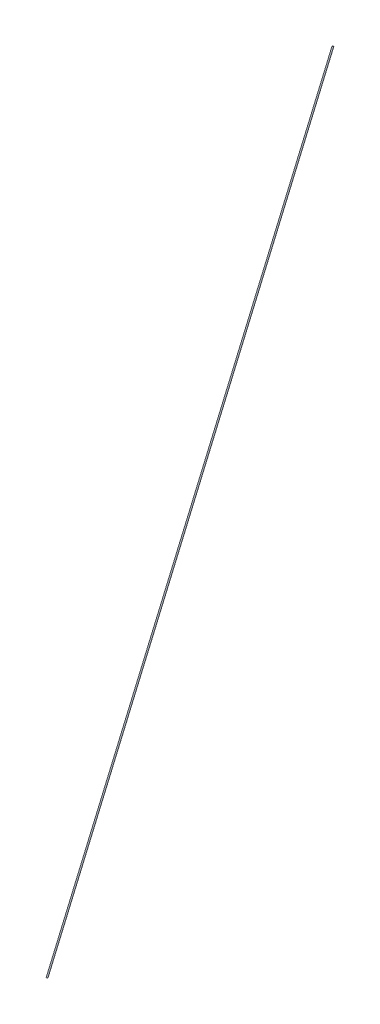
ISO-10303-21;
HEADER;
FILE_DESCRIPTION(('STEP AP214'),'2;1');
FILE_NAME('part.step','',(''),(''),'','','');
FILE_SCHEMA(('AUTOMOTIVE_DESIGN { 1 0 10303 214 1 1 1 1 }'));
ENDSEC;
DATA;
#1=APPLICATION_CONTEXT('core data for automotive mechanical design processes');
#2=APPLICATION_PROTOCOL_DEFINITION('international standard','automotive_design',2000,#1);
#3=PRODUCT_CONTEXT('',#1,'mechanical');
#4=PRODUCT('Part','Part','',(#3));
#5=PRODUCT_RELATED_PRODUCT_CATEGORY('part','',(#4));
#6=PRODUCT_DEFINITION_FORMATION('','',#4);
#7=PRODUCT_DEFINITION_CONTEXT('part definition',#1,'design');
#8=PRODUCT_DEFINITION('design','',#6,#7);
#9=PRODUCT_DEFINITION_SHAPE('','',#8);
#10=(LENGTH_UNIT() NAMED_UNIT(*) SI_UNIT(.MILLI.,.METRE.));
#11=(NAMED_UNIT(*) PLANE_ANGLE_UNIT() SI_UNIT($,.RADIAN.));
#12=(NAMED_UNIT(*) SI_UNIT($,.STERADIAN.) SOLID_ANGLE_UNIT());
#13=UNCERTAINTY_MEASURE_WITH_UNIT(LENGTH_MEASURE(1.E-05),#10,'distance_accuracy_value','');
#14=(GEOMETRIC_REPRESENTATION_CONTEXT(3) GLOBAL_UNCERTAINTY_ASSIGNED_CONTEXT((#13)) GLOBAL_UNIT_ASSIGNED_CONTEXT((#10,
#11,#12)) REPRESENTATION_CONTEXT('',''));
#15=CARTESIAN_POINT('',(0.,0.,0.));
#16=DIRECTION('',(0.,0.,1.));
#17=DIRECTION('',(1.,0.,0.));
#18=AXIS2_PLACEMENT_3D('',#15,#16,#17);
#19=CARTESIAN_POINT('',(0.,505.,0.));
#20=DIRECTION('',(0.,-0.918438029815543,0.395564894029466));
#21=DIRECTION('',(0.,-0.395564894029466,-0.918438029815543));
#22=AXIS2_PLACEMENT_3D('',#19,#20,#21);
#23=PLANE('',#22);
#24=CARTESIAN_POINT('',(0.,505.,0.));
#25=DIRECTION('',(0.,-0.918438029815543,0.395564894029466));
#26=DIRECTION('',(0.,-0.395564894029466,-0.918438029815543));
#27=AXIS2_PLACEMENT_3D('',#24,#25,#26);
#28=CIRCLE('',#27,0.5);
#29=CARTESIAN_POINT('',(0.,504.802217552985,-0.459219014907799));
#30=VERTEX_POINT('',#29);
#31=EDGE_CURVE('E47',#30,#30,#28,.T.);
#32=ORIENTED_EDGE('',*,*,#31,.F.);
#33=EDGE_LOOP('',(#32));
#34=FACE_BOUND('',#33,.T.);
#35=ADVANCED_FACE('F41',(#34),#23,.F.);
#36=CARTESIAN_POINT('',(0.,0.,217.5));
#37=DIRECTION('',(0.,-0.918438029815543,0.395564894029466));
#38=DIRECTION('',(0.,-0.395564894029466,-0.918438029815543));
#39=AXIS2_PLACEMENT_3D('',#36,#37,#38);
#40=PLANE('',#39);
#41=CARTESIAN_POINT('',(0.,0.,217.5));
#42=DIRECTION('',(0.,-0.918438029815543,0.395564894029466));
#43=DIRECTION('',(0.,-0.395564894029466,-0.918438029815543));
#44=AXIS2_PLACEMENT_3D('',#41,#42,#43);
#45=CIRCLE('',#44,0.5);
#46=CARTESIAN_POINT('',(0.,-0.197782447014733,217.040780985092));
#47=VERTEX_POINT('',#46);
#48=EDGE_CURVE('E11',#47,#47,#45,.T.);
#49=ORIENTED_EDGE('',*,*,#48,.T.);
#50=EDGE_LOOP('',(#49));
#51=FACE_BOUND('',#50,.T.);
#52=ADVANCED_FACE('F56',(#51),#40,.T.);
#53=CARTESIAN_POINT('',(0.,505.,0.));
#54=DIRECTION('',(0.,-0.918438029815543,0.395564894029467));
#55=DIRECTION('',(0.,-0.395564894029467,-0.918438029815543));
#56=AXIS2_PLACEMENT_3D('',#53,#54,#55);
#57=CYLINDRICAL_SURFACE('',#56,0.5);
#58=ORIENTED_EDGE('',*,*,#48,.F.);
#59=EDGE_LOOP('',(#58));
#60=FACE_BOUND('',#59,.T.);
#61=ORIENTED_EDGE('',*,*,#31,.T.);
#62=EDGE_LOOP('',(#61));
#63=FACE_BOUND('',#62,.T.);
#64=ADVANCED_FACE('F53',(#60,#63),#57,.T.);
#65=CLOSED_SHELL('',(#35,#52,#64));
#66=MANIFOLD_SOLID_BREP('B2',#65);
#67=ADVANCED_BREP_SHAPE_REPRESENTATION('',(#18,#66),#14);
#68=SHAPE_DEFINITION_REPRESENTATION(#9,#67);
ENDSEC;
END-ISO-10303-21;
